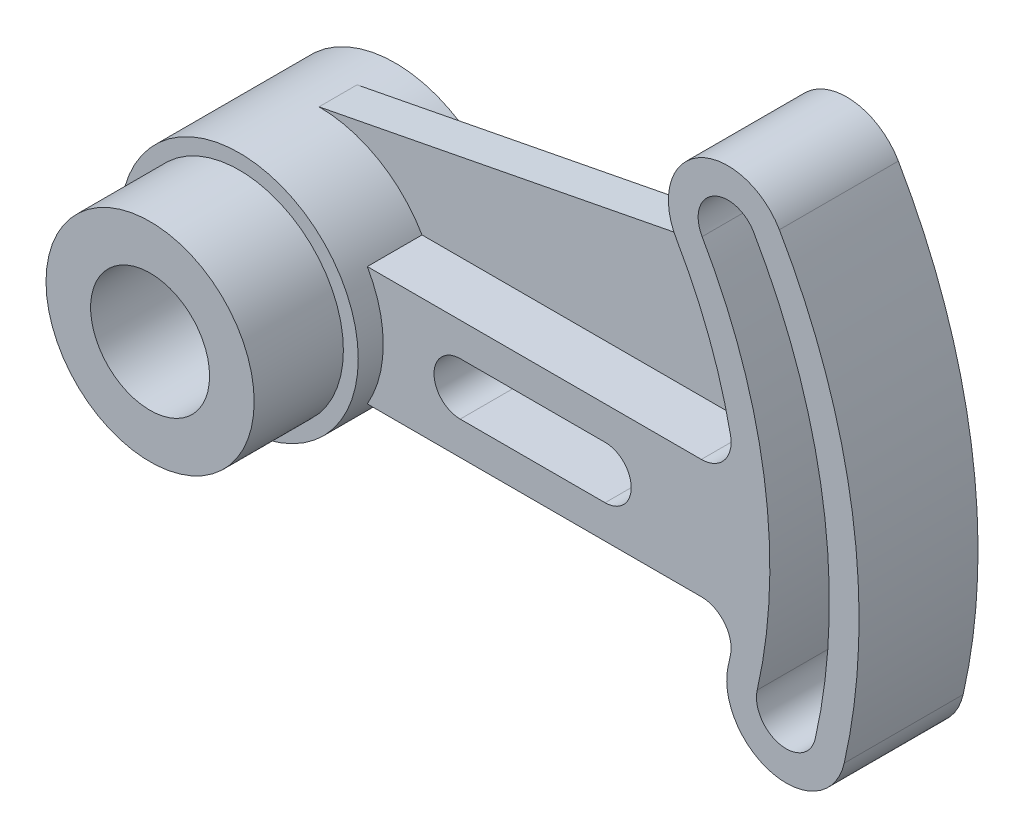
ISO-10303-21;
HEADER;
FILE_DESCRIPTION(('STEP AP214'),'2;1');
FILE_NAME('part.step','',(''),(''),'','','');
FILE_SCHEMA(('AUTOMOTIVE_DESIGN { 1 0 10303 214 1 1 1 1 }'));
ENDSEC;
DATA;
#1=APPLICATION_CONTEXT('core data for automotive mechanical design processes');
#2=APPLICATION_PROTOCOL_DEFINITION('international standard','automotive_design',2000,#1);
#3=PRODUCT_CONTEXT('',#1,'mechanical');
#4=PRODUCT('Part','Part','',(#3));
#5=PRODUCT_RELATED_PRODUCT_CATEGORY('part','',(#4));
#6=PRODUCT_DEFINITION_FORMATION('','',#4);
#7=PRODUCT_DEFINITION_CONTEXT('part definition',#1,'design');
#8=PRODUCT_DEFINITION('design','',#6,#7);
#9=PRODUCT_DEFINITION_SHAPE('','',#8);
#10=(LENGTH_UNIT() NAMED_UNIT(*) SI_UNIT(.MILLI.,.METRE.));
#11=(NAMED_UNIT(*) PLANE_ANGLE_UNIT() SI_UNIT($,.RADIAN.));
#12=(NAMED_UNIT(*) SI_UNIT($,.STERADIAN.) SOLID_ANGLE_UNIT());
#13=UNCERTAINTY_MEASURE_WITH_UNIT(LENGTH_MEASURE(1.E-05),#10,'distance_accuracy_value','');
#14=(GEOMETRIC_REPRESENTATION_CONTEXT(3) GLOBAL_UNCERTAINTY_ASSIGNED_CONTEXT((#13)) GLOBAL_UNIT_ASSIGNED_CONTEXT((#10,
#11,#12)) REPRESENTATION_CONTEXT('',''));
#15=CARTESIAN_POINT('',(0.,0.,0.));
#16=DIRECTION('',(0.,0.,1.));
#17=DIRECTION('',(1.,0.,0.));
#18=AXIS2_PLACEMENT_3D('',#15,#16,#17);
#19=CARTESIAN_POINT('',(0.,0.,27.94));
#20=DIRECTION('',(0.,0.,-1.));
#21=DIRECTION('',(-1.,0.,0.));
#22=AXIS2_PLACEMENT_3D('',#19,#20,#21);
#23=CYLINDRICAL_SURFACE('',#22,101.6);
#24=CARTESIAN_POINT('',(0.,0.,8.128));
#25=DIRECTION('',(0.,0.,1.));
#26=DIRECTION('',(1.,0.,0.));
#27=AXIS2_PLACEMENT_3D('',#24,#25,#26);
#28=CIRCLE('',#27,101.6);
#29=CARTESIAN_POINT('',(99.5472631467083,20.32,8.128));
#30=VERTEX_POINT('',#29);
#31=CARTESIAN_POINT('',(87.9881810244989,50.8000000000001,8.128));
#32=VERTEX_POINT('',#31);
#33=EDGE_CURVE('E55',#30,#32,#28,.T.);
#34=ORIENTED_EDGE('',*,*,#33,.T.);
#35=DIRECTION('',(0.,0.,-1.));
#36=VECTOR('',#35,1.);
#37=CARTESIAN_POINT('',(87.9881810244989,50.8000000000001,27.94));
#38=LINE('',#37,#36);
#39=CARTESIAN_POINT('',(87.9881810244989,50.8000000000001,2.54));
#40=VERTEX_POINT('',#39);
#41=EDGE_CURVE('E389',#32,#40,#38,.T.);
#42=ORIENTED_EDGE('',*,*,#41,.T.);
#43=CARTESIAN_POINT('',(0.,0.,2.54));
#44=DIRECTION('',(0.,0.,-1.));
#45=DIRECTION('',(-1.,0.,0.));
#46=AXIS2_PLACEMENT_3D('',#43,#44,#45);
#47=CIRCLE('',#46,101.6);
#48=CARTESIAN_POINT('',(99.5472631467083,20.32,2.54));
#49=VERTEX_POINT('',#48);
#50=EDGE_CURVE('E379',#40,#49,#47,.T.);
#51=ORIENTED_EDGE('',*,*,#50,.T.);
#52=DIRECTION('',(0.,0.,-1.));
#53=VECTOR('',#52,1.);
#54=CARTESIAN_POINT('',(99.5472631467083,20.32,27.94));
#55=LINE('',#54,#53);
#56=EDGE_CURVE('E456',#49,#30,#55,.F.);
#57=ORIENTED_EDGE('',*,*,#56,.T.);
#58=EDGE_LOOP('',(#34,#42,#51,#57));
#59=FACE_BOUND('',#58,.T.);
#60=ADVANCED_FACE('F39',(#59),#23,.F.);
#61=CARTESIAN_POINT('',(21.9970452561247,12.7,27.94));
#62=DIRECTION('',(0.,1.,0.));
#63=DIRECTION('',(0.,0.,1.));
#64=AXIS2_PLACEMENT_3D('',#61,#62,#63);
#65=PLANE('',#64);
#66=DIRECTION('',(0.,0.,-1.));
#67=VECTOR('',#66,1.);
#68=CARTESIAN_POINT('',(21.9970452561247,12.7,27.94));
#69=LINE('',#68,#67);
#70=CARTESIAN_POINT('',(21.9970452561247,12.7,8.128));
#71=VERTEX_POINT('',#70);
#72=CARTESIAN_POINT('',(21.9970452561247,12.7,2.54));
#73=VERTEX_POINT('',#72);
#74=EDGE_CURVE('E223',#71,#73,#69,.T.);
#75=ORIENTED_EDGE('',*,*,#74,.F.);
#76=DIRECTION('',(1.,0.,0.));
#77=VECTOR('',#76,1.);
#78=CARTESIAN_POINT('',(21.9970452561247,12.7,8.128));
#79=LINE('',#78,#77);
#80=CARTESIAN_POINT('',(93.3255592000391,12.7,8.128));
#81=VERTEX_POINT('',#80);
#82=EDGE_CURVE('E221',#71,#81,#79,.T.);
#83=ORIENTED_EDGE('',*,*,#82,.T.);
#84=DIRECTION('',(0.,0.,-1.));
#85=VECTOR('',#84,1.);
#86=CARTESIAN_POINT('',(93.3255592000391,12.7,27.94));
#87=LINE('',#86,#85);
#88=CARTESIAN_POINT('',(93.3255592000391,12.7,2.54));
#89=VERTEX_POINT('',#88);
#90=EDGE_CURVE('E205',#81,#89,#87,.T.);
#91=ORIENTED_EDGE('',*,*,#90,.T.);
#92=DIRECTION('',(1.,0.,0.));
#93=VECTOR('',#92,1.);
#94=CARTESIAN_POINT('',(21.9970452561247,12.7,2.54));
#95=LINE('',#94,#93);
#96=EDGE_CURVE('E340',#73,#89,#95,.T.);
#97=ORIENTED_EDGE('',*,*,#96,.F.);
#98=EDGE_LOOP('',(#75,#83,#91,#97));
#99=FACE_BOUND('',#98,.T.);
#100=ADVANCED_FACE('F222',(#99),#65,.T.);
#101=CARTESIAN_POINT('',(93.3255592000391,19.05,27.94));
#102=DIRECTION('',(0.,0.,-1.));
#103=DIRECTION('',(-1.,0.,0.));
#104=AXIS2_PLACEMENT_3D('',#101,#102,#103);
#105=CYLINDRICAL_SURFACE('',#104,6.35);
#106=CARTESIAN_POINT('',(93.3255592000391,19.05,8.128));
#107=DIRECTION('',(0.,0.,1.));
#108=DIRECTION('',(1.,0.,0.));
#109=AXIS2_PLACEMENT_3D('',#106,#107,#108);
#110=CIRCLE('',#109,6.35);
#111=EDGE_CURVE('E210',#81,#30,#110,.T.);
#112=ORIENTED_EDGE('',*,*,#111,.T.);
#113=ORIENTED_EDGE('',*,*,#56,.F.);
#114=CARTESIAN_POINT('',(93.3255592000391,19.05,2.54));
#115=DIRECTION('',(0.,0.,1.));
#116=DIRECTION('',(1.,0.,0.));
#117=AXIS2_PLACEMENT_3D('',#114,#115,#116);
#118=CIRCLE('',#117,6.35);
#119=EDGE_CURVE('E211',#89,#49,#118,.T.);
#120=ORIENTED_EDGE('',*,*,#119,.F.);
#121=ORIENTED_EDGE('',*,*,#90,.F.);
#122=EDGE_LOOP('',(#112,#113,#120,#121));
#123=FACE_BOUND('',#122,.T.);
#124=ADVANCED_FACE('F207',(#123),#105,.F.);
#125=CARTESIAN_POINT('',(0.,0.,27.94));
#126=DIRECTION('',(0.,0.,1.));
#127=DIRECTION('',(1.,0.,0.));
#128=AXIS2_PLACEMENT_3D('',#125,#126,#127);
#129=PLANE('',#128);
#130=CARTESIAN_POINT('',(0.,0.,27.94));
#131=DIRECTION('',(0.,0.,1.));
#132=DIRECTION('',(1.,0.,0.));
#133=AXIS2_PLACEMENT_3D('',#130,#131,#132);
#134=CIRCLE('',#133,25.4);
#135=CARTESIAN_POINT('',(21.9970452561247,-12.7,27.94));
#136=VERTEX_POINT('',#135);
#137=CARTESIAN_POINT('',(21.9970452561247,12.7,27.94));
#138=VERTEX_POINT('',#137);
#139=EDGE_CURVE('E413',#136,#138,#134,.T.);
#140=ORIENTED_EDGE('',*,*,#139,.F.);
#141=DIRECTION('',(1.,0.,0.));
#142=VECTOR('',#141,1.);
#143=CARTESIAN_POINT('',(21.9970452561247,-12.7,27.94));
#144=LINE('',#143,#142);
#145=CARTESIAN_POINT('',(93.3255592000391,-12.7,27.94));
#146=VERTEX_POINT('',#145);
#147=EDGE_CURVE('E335',#136,#146,#144,.T.);
#148=ORIENTED_EDGE('',*,*,#147,.T.);
#149=CARTESIAN_POINT('',(93.3255592000391,-19.05,27.94));
#150=DIRECTION('',(0.,0.,1.));
#151=DIRECTION('',(1.,0.,0.));
#152=AXIS2_PLACEMENT_3D('',#149,#150,#151);
#153=CIRCLE('',#152,6.35);
#154=CARTESIAN_POINT('',(99.5472631467083,-20.32,27.94));
#155=VERTEX_POINT('',#154);
#156=EDGE_CURVE('E462',#146,#155,#153,.F.);
#157=ORIENTED_EDGE('',*,*,#156,.T.);
#158=CARTESIAN_POINT('',(0.,0.,27.94));
#159=DIRECTION('',(0.,0.,-1.));
#160=DIRECTION('',(-1.,0.,0.));
#161=AXIS2_PLACEMENT_3D('',#158,#159,#160);
#162=CIRCLE('',#161,101.6);
#163=CARTESIAN_POINT('',(99.0595979732266,-22.5777777777778,27.94));
#164=VERTEX_POINT('',#163);
#165=EDGE_CURVE('E339',#155,#164,#162,.T.);
#166=ORIENTED_EDGE('',*,*,#165,.T.);
#167=CARTESIAN_POINT('',(111.44204771988,-25.4,27.94));
#168=DIRECTION('',(0.,0.,1.));
#169=DIRECTION('',(1.,0.,0.));
#170=AXIS2_PLACEMENT_3D('',#167,#168,#169);
#171=CIRCLE('',#170,12.7);
#172=CARTESIAN_POINT('',(123.824497466533,-28.2222222222222,27.94));
#173=VERTEX_POINT('',#172);
#174=EDGE_CURVE('E343',#164,#173,#171,.T.);
#175=ORIENTED_EDGE('',*,*,#174,.T.);
#176=CARTESIAN_POINT('',(0.,0.,27.94));
#177=DIRECTION('',(0.,0.,-1.));
#178=DIRECTION('',(-1.,0.,0.));
#179=AXIS2_PLACEMENT_3D('',#176,#177,#178);
#180=CIRCLE('',#179,127.);
#181=CARTESIAN_POINT('',(109.985226280624,63.5000000000002,27.94));
#182=VERTEX_POINT('',#181);
#183=EDGE_CURVE('E346',#182,#173,#180,.T.);
#184=ORIENTED_EDGE('',*,*,#183,.F.);
#185=CARTESIAN_POINT('',(98.9867036525612,57.1500000000002,27.94));
#186=DIRECTION('',(0.,0.,1.));
#187=DIRECTION('',(1.,0.,0.));
#188=AXIS2_PLACEMENT_3D('',#185,#186,#187);
#189=CIRCLE('',#188,12.7);
#190=CARTESIAN_POINT('',(87.9881810244989,50.8000000000001,27.94));
#191=VERTEX_POINT('',#190);
#192=EDGE_CURVE('E350',#182,#191,#189,.T.);
#193=ORIENTED_EDGE('',*,*,#192,.T.);
#194=CARTESIAN_POINT('',(0.,0.,27.94));
#195=DIRECTION('',(0.,0.,-1.));
#196=DIRECTION('',(-1.,0.,0.));
#197=AXIS2_PLACEMENT_3D('',#194,#195,#196);
#198=CIRCLE('',#197,101.6);
#199=CARTESIAN_POINT('',(99.5472631467083,20.32,27.94));
#200=VERTEX_POINT('',#199);
#201=EDGE_CURVE('E353',#191,#200,#198,.T.);
#202=ORIENTED_EDGE('',*,*,#201,.T.);
#203=CARTESIAN_POINT('',(93.3255592000391,19.05,27.94));
#204=DIRECTION('',(0.,0.,1.));
#205=DIRECTION('',(1.,0.,0.));
#206=AXIS2_PLACEMENT_3D('',#203,#204,#205);
#207=CIRCLE('',#206,6.35);
#208=CARTESIAN_POINT('',(93.3255592000391,12.7,27.94));
#209=VERTEX_POINT('',#208);
#210=EDGE_CURVE('E467',#200,#209,#207,.F.);
#211=ORIENTED_EDGE('',*,*,#210,.T.);
#212=DIRECTION('',(1.,0.,0.));
#213=VECTOR('',#212,1.);
#214=CARTESIAN_POINT('',(21.9970452561247,12.7,27.94));
#215=LINE('',#214,#213);
#216=EDGE_CURVE('E357',#138,#209,#215,.T.);
#217=ORIENTED_EDGE('',*,*,#216,.F.);
#218=EDGE_LOOP('',(#140,#148,#157,#166,#175,#184,#193,#202,#211,#217));
#219=FACE_BOUND('',#218,.T.);
#220=CARTESIAN_POINT('',(0.,0.,27.94));
#221=DIRECTION('',(0.,0.,1.));
#222=DIRECTION('',(1.,0.,0.));
#223=AXIS2_PLACEMENT_3D('',#220,#221,#222);
#224=CIRCLE('',#223,120.65);
#225=CARTESIAN_POINT('',(104.485964966592,60.3250000000001,27.94));
#226=VERTEX_POINT('',#225);
#227=CARTESIAN_POINT('',(117.633272593207,-26.8111111111111,27.94));
#228=VERTEX_POINT('',#227);
#229=EDGE_CURVE('E310',#226,#228,#224,.F.);
#230=ORIENTED_EDGE('',*,*,#229,.T.);
#231=CARTESIAN_POINT('',(111.44204771988,-25.4,27.94));
#232=DIRECTION('',(0.,0.,1.));
#233=DIRECTION('',(1.,0.,0.));
#234=AXIS2_PLACEMENT_3D('',#231,#232,#233);
#235=CIRCLE('',#234,6.34999999999999);
#236=CARTESIAN_POINT('',(105.250822846553,-23.9888888888889,27.94));
#237=VERTEX_POINT('',#236);
#238=EDGE_CURVE('E314',#228,#237,#235,.F.);
#239=ORIENTED_EDGE('',*,*,#238,.T.);
#240=CARTESIAN_POINT('',(0.,0.,27.94));
#241=DIRECTION('',(0.,0.,1.));
#242=DIRECTION('',(1.,0.,0.));
#243=AXIS2_PLACEMENT_3D('',#240,#241,#242);
#244=CIRCLE('',#243,107.95);
#245=CARTESIAN_POINT('',(93.4874423385301,53.9750000000002,27.94));
#246=VERTEX_POINT('',#245);
#247=EDGE_CURVE('E275',#237,#246,#244,.T.);
#248=ORIENTED_EDGE('',*,*,#247,.T.);
#249=CARTESIAN_POINT('',(98.9867036525612,57.1500000000002,27.94));
#250=DIRECTION('',(0.,0.,1.));
#251=DIRECTION('',(1.,0.,0.));
#252=AXIS2_PLACEMENT_3D('',#249,#250,#251);
#253=CIRCLE('',#252,6.34999999999998);
#254=EDGE_CURVE('E306',#246,#226,#253,.F.);
#255=ORIENTED_EDGE('',*,*,#254,.T.);
#256=EDGE_LOOP('',(#230,#239,#248,#255));
#257=FACE_BOUND('',#256,.T.);
#258=DIRECTION('',(-1.,0.,0.));
#259=VECTOR('',#258,1.);
#260=CARTESIAN_POINT('',(0.,-5.58800000000001,27.94));
#261=LINE('',#260,#259);
#262=CARTESIAN_POINT('',(72.7664661050943,-5.58799999999999,27.94));
#263=VERTEX_POINT('',#262);
#264=CARTESIAN_POINT('',(41.8340954673085,-5.588,27.94));
#265=VERTEX_POINT('',#264);
#266=EDGE_CURVE('E326',#263,#265,#261,.T.);
#267=ORIENTED_EDGE('',*,*,#266,.T.);
#268=CARTESIAN_POINT('',(41.8340954673085,0.,27.94));
#269=DIRECTION('',(0.,0.,1.));
#270=DIRECTION('',(1.,0.,0.));
#271=AXIS2_PLACEMENT_3D('',#268,#269,#270);
#272=CIRCLE('',#271,5.588);
#273=CARTESIAN_POINT('',(41.8340954673085,5.588,27.94));
#274=VERTEX_POINT('',#273);
#275=EDGE_CURVE('E330',#265,#274,#272,.F.);
#276=ORIENTED_EDGE('',*,*,#275,.T.);
#277=DIRECTION('',(1.,0.,0.));
#278=VECTOR('',#277,1.);
#279=CARTESIAN_POINT('',(0.,5.58800000000001,27.94));
#280=LINE('',#279,#278);
#281=CARTESIAN_POINT('',(72.7664661050943,5.58799999999999,27.94));
#282=VERTEX_POINT('',#281);
#283=EDGE_CURVE('E318',#274,#282,#280,.T.);
#284=ORIENTED_EDGE('',*,*,#283,.T.);
#285=CARTESIAN_POINT('',(72.7664661050943,0.,27.94));
#286=DIRECTION('',(0.,0.,1.));
#287=DIRECTION('',(1.,0.,0.));
#288=AXIS2_PLACEMENT_3D('',#285,#286,#287);
#289=CIRCLE('',#288,5.58799999999999);
#290=EDGE_CURVE('E322',#282,#263,#289,.F.);
#291=ORIENTED_EDGE('',*,*,#290,.T.);
#292=EDGE_LOOP('',(#267,#276,#284,#291));
#293=FACE_BOUND('',#292,.T.);
#294=ADVANCED_FACE('F535',(#219,#257,#293),#129,.T.);
#295=CARTESIAN_POINT('',(0.,0.,2.54));
#296=DIRECTION('',(0.,0.,1.));
#297=DIRECTION('',(1.,0.,0.));
#298=AXIS2_PLACEMENT_3D('',#295,#296,#297);
#299=PLANE('',#298);
#300=CARTESIAN_POINT('',(111.44204771988,-25.4,2.54));
#301=DIRECTION('',(0.,0.,1.));
#302=DIRECTION('',(1.,0.,0.));
#303=AXIS2_PLACEMENT_3D('',#300,#301,#302);
#304=CIRCLE('',#303,6.34999999999999);
#305=CARTESIAN_POINT('',(105.250822846553,-23.9888888888889,2.54));
#306=VERTEX_POINT('',#305);
#307=CARTESIAN_POINT('',(117.633272593207,-26.8111111111111,2.54));
#308=VERTEX_POINT('',#307);
#309=EDGE_CURVE('E243',#306,#308,#304,.T.);
#310=ORIENTED_EDGE('',*,*,#309,.T.);
#311=CARTESIAN_POINT('',(0.,0.,2.54));
#312=DIRECTION('',(0.,0.,1.));
#313=DIRECTION('',(1.,0.,0.));
#314=AXIS2_PLACEMENT_3D('',#311,#312,#313);
#315=CIRCLE('',#314,120.65);
#316=CARTESIAN_POINT('',(104.485964966592,60.3250000000001,2.54));
#317=VERTEX_POINT('',#316);
#318=EDGE_CURVE('E279',#308,#317,#315,.T.);
#319=ORIENTED_EDGE('',*,*,#318,.T.);
#320=CARTESIAN_POINT('',(98.9867036525612,57.1500000000002,2.54));
#321=DIRECTION('',(0.,0.,1.));
#322=DIRECTION('',(1.,0.,0.));
#323=AXIS2_PLACEMENT_3D('',#320,#321,#322);
#324=CIRCLE('',#323,6.34999999999998);
#325=CARTESIAN_POINT('',(93.4874423385301,53.9750000000002,2.54));
#326=VERTEX_POINT('',#325);
#327=EDGE_CURVE('E283',#317,#326,#324,.T.);
#328=ORIENTED_EDGE('',*,*,#327,.T.);
#329=CARTESIAN_POINT('',(0.,0.,2.54));
#330=DIRECTION('',(0.,0.,-1.));
#331=DIRECTION('',(1.,0.,0.));
#332=AXIS2_PLACEMENT_3D('',#329,#330,#331);
#333=CIRCLE('',#332,107.95);
#334=EDGE_CURVE('E287',#326,#306,#333,.T.);
#335=ORIENTED_EDGE('',*,*,#334,.T.);
#336=EDGE_LOOP('',(#310,#319,#328,#335));
#337=FACE_BOUND('',#336,.T.);
#338=DIRECTION('',(1.,0.,0.));
#339=VECTOR('',#338,1.);
#340=CARTESIAN_POINT('',(21.9970452561247,-12.7,2.54));
#341=LINE('',#340,#339);
#342=CARTESIAN_POINT('',(21.9970452561247,-12.7,2.54));
#343=VERTEX_POINT('',#342);
#344=CARTESIAN_POINT('',(93.3255592000391,-12.7,2.54));
#345=VERTEX_POINT('',#344);
#346=EDGE_CURVE('E334',#343,#345,#341,.T.);
#347=ORIENTED_EDGE('',*,*,#346,.F.);
#348=CARTESIAN_POINT('',(0.,0.,2.54));
#349=DIRECTION('',(0.,0.,1.));
#350=DIRECTION('',(1.,0.,0.));
#351=AXIS2_PLACEMENT_3D('',#348,#349,#350);
#352=CIRCLE('',#351,25.4);
#353=EDGE_CURVE('E409',#343,#73,#352,.T.);
#354=ORIENTED_EDGE('',*,*,#353,.T.);
#355=ORIENTED_EDGE('',*,*,#96,.T.);
#356=ORIENTED_EDGE('',*,*,#119,.T.);
#357=ORIENTED_EDGE('',*,*,#50,.F.);
#358=CARTESIAN_POINT('',(98.9867036525612,57.1500000000002,2.54));
#359=DIRECTION('',(0.,0.,1.));
#360=DIRECTION('',(1.,0.,0.));
#361=AXIS2_PLACEMENT_3D('',#358,#359,#360);
#362=CIRCLE('',#361,12.7);
#363=CARTESIAN_POINT('',(109.985226280624,63.5000000000002,2.54));
#364=VERTEX_POINT('',#363);
#365=EDGE_CURVE('E375',#364,#40,#362,.T.);
#366=ORIENTED_EDGE('',*,*,#365,.F.);
#367=CARTESIAN_POINT('',(0.,0.,2.54));
#368=DIRECTION('',(0.,0.,-1.));
#369=DIRECTION('',(-1.,0.,0.));
#370=AXIS2_PLACEMENT_3D('',#367,#368,#369);
#371=CIRCLE('',#370,127.);
#372=CARTESIAN_POINT('',(123.824497466533,-28.2222222222222,2.54));
#373=VERTEX_POINT('',#372);
#374=EDGE_CURVE('E371',#364,#373,#371,.T.);
#375=ORIENTED_EDGE('',*,*,#374,.T.);
#376=CARTESIAN_POINT('',(111.44204771988,-25.4,2.54));
#377=DIRECTION('',(0.,0.,1.));
#378=DIRECTION('',(1.,0.,0.));
#379=AXIS2_PLACEMENT_3D('',#376,#377,#378);
#380=CIRCLE('',#379,12.7);
#381=CARTESIAN_POINT('',(99.0595979732266,-22.5777777777778,2.54));
#382=VERTEX_POINT('',#381);
#383=EDGE_CURVE('E367',#382,#373,#380,.T.);
#384=ORIENTED_EDGE('',*,*,#383,.F.);
#385=CARTESIAN_POINT('',(0.,0.,2.54));
#386=DIRECTION('',(0.,0.,-1.));
#387=DIRECTION('',(-1.,0.,0.));
#388=AXIS2_PLACEMENT_3D('',#385,#386,#387);
#389=CIRCLE('',#388,101.6);
#390=CARTESIAN_POINT('',(99.5472631467083,-20.32,2.54));
#391=VERTEX_POINT('',#390);
#392=EDGE_CURVE('E364',#391,#382,#389,.T.);
#393=ORIENTED_EDGE('',*,*,#392,.F.);
#394=CARTESIAN_POINT('',(93.3255592000391,-19.05,2.54));
#395=DIRECTION('',(0.,0.,1.));
#396=DIRECTION('',(1.,0.,0.));
#397=AXIS2_PLACEMENT_3D('',#394,#395,#396);
#398=CIRCLE('',#397,6.35);
#399=EDGE_CURVE('E459',#391,#345,#398,.T.);
#400=ORIENTED_EDGE('',*,*,#399,.T.);
#401=EDGE_LOOP('',(#347,#354,#355,#356,#357,#366,#375,#384,#393,#400));
#402=FACE_BOUND('',#401,.T.);
#403=CARTESIAN_POINT('',(41.8340954673085,0.,2.54));
#404=DIRECTION('',(0.,0.,1.));
#405=DIRECTION('',(1.,0.,0.));
#406=AXIS2_PLACEMENT_3D('',#403,#404,#405);
#407=CIRCLE('',#406,5.588);
#408=CARTESIAN_POINT('',(41.8340954673085,5.588,2.54));
#409=VERTEX_POINT('',#408);
#410=CARTESIAN_POINT('',(41.8340954673085,-5.588,2.54));
#411=VERTEX_POINT('',#410);
#412=EDGE_CURVE('E245',#409,#411,#407,.T.);
#413=ORIENTED_EDGE('',*,*,#412,.T.);
#414=DIRECTION('',(1.,0.,0.));
#415=VECTOR('',#414,1.);
#416=CARTESIAN_POINT('',(41.8340954673085,-5.588,2.54));
#417=LINE('',#416,#415);
#418=CARTESIAN_POINT('',(72.7664661050943,-5.58799999999999,2.54));
#419=VERTEX_POINT('',#418);
#420=EDGE_CURVE('E249',#411,#419,#417,.T.);
#421=ORIENTED_EDGE('',*,*,#420,.T.);
#422=CARTESIAN_POINT('',(72.7664661050943,0.,2.54));
#423=DIRECTION('',(0.,0.,1.));
#424=DIRECTION('',(1.,0.,0.));
#425=AXIS2_PLACEMENT_3D('',#422,#423,#424);
#426=CIRCLE('',#425,5.58799999999999);
#427=CARTESIAN_POINT('',(72.7664661050943,5.58799999999999,2.54));
#428=VERTEX_POINT('',#427);
#429=EDGE_CURVE('E254',#419,#428,#426,.T.);
#430=ORIENTED_EDGE('',*,*,#429,.T.);
#431=DIRECTION('',(-1.,0.,0.));
#432=VECTOR('',#431,1.);
#433=CARTESIAN_POINT('',(41.8340954673085,5.588,2.54));
#434=LINE('',#433,#432);
#435=EDGE_CURVE('E258',#428,#409,#434,.T.);
#436=ORIENTED_EDGE('',*,*,#435,.T.);
#437=EDGE_LOOP('',(#413,#421,#430,#436));
#438=FACE_BOUND('',#437,.T.);
#439=ADVANCED_FACE('F526',(#337,#402,#438),#299,.F.);
#440=CARTESIAN_POINT('',(0.,0.,52.324));
#441=DIRECTION('',(0.,0.,-1.));
#442=DIRECTION('',(-1.,0.,0.));
#443=AXIS2_PLACEMENT_3D('',#440,#441,#442);
#444=CYLINDRICAL_SURFACE('',#443,12.7);
#445=CARTESIAN_POINT('',(0.,0.,0.));
#446=DIRECTION('',(0.,0.,1.));
#447=DIRECTION('',(1.,0.,0.));
#448=AXIS2_PLACEMENT_3D('',#445,#446,#447);
#449=CIRCLE('',#448,12.7);
#450=CARTESIAN_POINT('',(12.7,0.,0.));
#451=VERTEX_POINT('',#450);
#452=EDGE_CURVE('E416',#451,#451,#449,.T.);
#453=ORIENTED_EDGE('',*,*,#452,.F.);
#454=EDGE_LOOP('',(#453));
#455=FACE_BOUND('',#454,.T.);
#456=CARTESIAN_POINT('',(0.,0.,2.54));
#457=DIRECTION('',(0.,0.,1.));
#458=DIRECTION('',(1.,0.,0.));
#459=AXIS2_PLACEMENT_3D('',#456,#457,#458);
#460=CIRCLE('',#459,12.7);
#461=CARTESIAN_POINT('',(12.7,0.,2.54));
#462=VERTEX_POINT('',#461);
#463=EDGE_CURVE('E408',#462,#462,#460,.T.);
#464=ORIENTED_EDGE('',*,*,#463,.T.);
#465=EDGE_LOOP('',(#464));
#466=FACE_BOUND('',#465,.T.);
#467=ADVANCED_FACE('F607',(#455,#466),#444,.F.);
#468=CARTESIAN_POINT('',(0.,0.,33.274));
#469=DIRECTION('',(0.,0.,-1.));
#470=DIRECTION('',(-1.,0.,0.));
#471=AXIS2_PLACEMENT_3D('',#468,#469,#470);
#472=CYLINDRICAL_SURFACE('',#471,25.4);
#473=CARTESIAN_POINT('',(21.9970452561247,12.7,16.256));
#474=VERTEX_POINT('',#473);
#475=EDGE_CURVE('E385',#138,#474,#69,.T.);
#476=ORIENTED_EDGE('',*,*,#475,.T.);
#477=CARTESIAN_POINT('',(0.,0.,16.256));
#478=DIRECTION('',(0.,0.,-1.));
#479=DIRECTION('',(1.,0.,0.));
#480=AXIS2_PLACEMENT_3D('',#477,#478,#479);
#481=CIRCLE('',#480,25.4);
#482=CARTESIAN_POINT('',(0.,25.4,16.256));
#483=VERTEX_POINT('',#482);
#484=EDGE_CURVE('E238',#483,#474,#481,.T.);
#485=ORIENTED_EDGE('',*,*,#484,.F.);
#486=DIRECTION('',(0.,0.,-1.));
#487=VECTOR('',#486,1.);
#488=CARTESIAN_POINT('',(0.,25.4,16.256));
#489=LINE('',#488,#487);
#490=CARTESIAN_POINT('',(0.,25.4,8.128));
#491=VERTEX_POINT('',#490);
#492=EDGE_CURVE('E239',#483,#491,#489,.T.);
#493=ORIENTED_EDGE('',*,*,#492,.T.);
#494=CARTESIAN_POINT('',(0.,0.,8.128));
#495=DIRECTION('',(0.,0.,-1.));
#496=DIRECTION('',(1.,0.,0.));
#497=AXIS2_PLACEMENT_3D('',#494,#495,#496);
#498=CIRCLE('',#497,25.4);
#499=EDGE_CURVE('E226',#491,#71,#498,.T.);
#500=ORIENTED_EDGE('',*,*,#499,.T.);
#501=ORIENTED_EDGE('',*,*,#74,.T.);
#502=ORIENTED_EDGE('',*,*,#353,.F.);
#503=DIRECTION('',(0.,0.,-1.));
#504=VECTOR('',#503,1.);
#505=CARTESIAN_POINT('',(21.9970452561247,-12.7,27.94));
#506=LINE('',#505,#504);
#507=EDGE_CURVE('E404',#136,#343,#506,.T.);
#508=ORIENTED_EDGE('',*,*,#507,.F.);
#509=ORIENTED_EDGE('',*,*,#139,.T.);
#510=EDGE_LOOP('',(#476,#485,#493,#500,#501,#502,#508,#509));
#511=FACE_BOUND('',#510,.T.);
#512=CARTESIAN_POINT('',(0.,0.,33.274));
#513=DIRECTION('',(0.,0.,1.));
#514=DIRECTION('',(1.,0.,0.));
#515=AXIS2_PLACEMENT_3D('',#512,#513,#514);
#516=CIRCLE('',#515,25.4);
#517=CARTESIAN_POINT('',(25.4,0.,33.274));
#518=VERTEX_POINT('',#517);
#519=EDGE_CURVE('E434',#518,#518,#516,.T.);
#520=ORIENTED_EDGE('',*,*,#519,.F.);
#521=EDGE_LOOP('',(#520));
#522=FACE_BOUND('',#521,.T.);
#523=CARTESIAN_POINT('',(0.,0.,0.));
#524=DIRECTION('',(0.,0.,1.));
#525=DIRECTION('',(1.,0.,0.));
#526=AXIS2_PLACEMENT_3D('',#523,#524,#525);
#527=CIRCLE('',#526,25.4);
#528=CARTESIAN_POINT('',(25.4,0.,0.));
#529=VERTEX_POINT('',#528);
#530=EDGE_CURVE('E428',#529,#529,#527,.T.);
#531=ORIENTED_EDGE('',*,*,#530,.T.);
#532=EDGE_LOOP('',(#531));
#533=FACE_BOUND('',#532,.T.);
#534=ADVANCED_FACE('F508',(#511,#522,#533),#472,.T.);
#535=CARTESIAN_POINT('',(0.,0.,33.274));
#536=DIRECTION('',(0.,0.,1.));
#537=DIRECTION('',(1.,0.,0.));
#538=AXIS2_PLACEMENT_3D('',#535,#536,#537);
#539=PLANE('',#538);
#540=CARTESIAN_POINT('',(0.,0.,33.274));
#541=DIRECTION('',(0.,0.,1.));
#542=DIRECTION('',(1.,0.,0.));
#543=AXIS2_PLACEMENT_3D('',#540,#541,#542);
#544=CIRCLE('',#543,22.225);
#545=CARTESIAN_POINT('',(-22.225,0.,33.274));
#546=VERTEX_POINT('',#545);
#547=EDGE_CURVE('E429',#546,#546,#544,.T.);
#548=ORIENTED_EDGE('',*,*,#547,.F.);
#549=EDGE_LOOP('',(#548));
#550=FACE_BOUND('',#549,.T.);
#551=ORIENTED_EDGE('',*,*,#519,.T.);
#552=EDGE_LOOP('',(#551));
#553=FACE_BOUND('',#552,.T.);
#554=ADVANCED_FACE('F616',(#550,#553),#539,.T.);
#555=CARTESIAN_POINT('',(0.,0.,0.));
#556=DIRECTION('',(0.,0.,1.));
#557=DIRECTION('',(1.,0.,0.));
#558=AXIS2_PLACEMENT_3D('',#555,#556,#557);
#559=PLANE('',#558);
#560=ORIENTED_EDGE('',*,*,#452,.T.);
#561=EDGE_LOOP('',(#560));
#562=FACE_BOUND('',#561,.T.);
#563=ORIENTED_EDGE('',*,*,#530,.F.);
#564=EDGE_LOOP('',(#563));
#565=FACE_BOUND('',#564,.T.);
#566=ADVANCED_FACE('F614',(#562,#565),#559,.F.);
#567=CARTESIAN_POINT('',(0.,0.,52.324));
#568=DIRECTION('',(0.,0.,-1.));
#569=DIRECTION('',(-1.,0.,0.));
#570=AXIS2_PLACEMENT_3D('',#567,#568,#569);
#571=CYLINDRICAL_SURFACE('',#570,22.225);
#572=CARTESIAN_POINT('',(0.,0.,52.324));
#573=DIRECTION('',(0.,0.,1.));
#574=DIRECTION('',(1.,0.,0.));
#575=AXIS2_PLACEMENT_3D('',#572,#573,#574);
#576=CIRCLE('',#575,22.225);
#577=CARTESIAN_POINT('',(-22.225,0.,52.324));
#578=VERTEX_POINT('',#577);
#579=EDGE_CURVE('E421',#578,#578,#576,.T.);
#580=CARTESIAN_POINT('',(-22.225,0.,52.324));
#581=CARTESIAN_POINT('',(-22.225,0.,52.1255625));
#582=CARTESIAN_POINT('',(-22.225,0.,51.927125));
#583=CARTESIAN_POINT('',(-22.225,0.,51.53025));
#584=CARTESIAN_POINT('',(-22.225,0.,51.3318125));
#585=CARTESIAN_POINT('',(-22.225,0.,50.9349375));
#586=CARTESIAN_POINT('',(-22.225,0.,50.7365));
#587=CARTESIAN_POINT('',(-22.225,0.,50.339625));
#588=CARTESIAN_POINT('',(-22.225,0.,50.1411875));
#589=CARTESIAN_POINT('',(-22.225,0.,49.7443125));
#590=CARTESIAN_POINT('',(-22.225,0.,49.545875));
#591=CARTESIAN_POINT('',(-22.225,0.,49.149));
#592=CARTESIAN_POINT('',(-22.225,0.,48.9505625));
#593=CARTESIAN_POINT('',(-22.225,0.,48.5536875));
#594=CARTESIAN_POINT('',(-22.225,0.,48.35525));
#595=CARTESIAN_POINT('',(-22.225,0.,47.958375));
#596=CARTESIAN_POINT('',(-22.225,0.,47.7599375));
#597=CARTESIAN_POINT('',(-22.225,0.,47.3630625));
#598=CARTESIAN_POINT('',(-22.225,0.,47.164625));
#599=CARTESIAN_POINT('',(-22.225,0.,46.76775));
#600=CARTESIAN_POINT('',(-22.225,0.,46.5693125));
#601=CARTESIAN_POINT('',(-22.225,0.,46.1724375));
#602=CARTESIAN_POINT('',(-22.225,0.,45.974));
#603=CARTESIAN_POINT('',(-22.225,0.,45.577125));
#604=CARTESIAN_POINT('',(-22.225,0.,45.3786875));
#605=CARTESIAN_POINT('',(-22.225,0.,44.9818125));
#606=CARTESIAN_POINT('',(-22.225,0.,44.783375));
#607=CARTESIAN_POINT('',(-22.225,0.,44.3865));
#608=CARTESIAN_POINT('',(-22.225,0.,44.1880625));
#609=CARTESIAN_POINT('',(-22.225,0.,43.7911875));
#610=CARTESIAN_POINT('',(-22.225,0.,43.59275));
#611=CARTESIAN_POINT('',(-22.225,0.,43.195875));
#612=CARTESIAN_POINT('',(-22.225,0.,42.9974375));
#613=CARTESIAN_POINT('',(-22.225,0.,42.6005625));
#614=CARTESIAN_POINT('',(-22.225,0.,42.402125));
#615=CARTESIAN_POINT('',(-22.225,0.,42.00525));
#616=CARTESIAN_POINT('',(-22.225,0.,41.8068125));
#617=CARTESIAN_POINT('',(-22.225,0.,41.4099375));
#618=CARTESIAN_POINT('',(-22.225,0.,41.2115));
#619=CARTESIAN_POINT('',(-22.225,0.,40.814625));
#620=CARTESIAN_POINT('',(-22.225,0.,40.6161875));
#621=CARTESIAN_POINT('',(-22.225,0.,40.2193125));
#622=CARTESIAN_POINT('',(-22.225,0.,40.020875));
#623=CARTESIAN_POINT('',(-22.225,0.,39.624));
#624=CARTESIAN_POINT('',(-22.225,0.,39.4255625));
#625=CARTESIAN_POINT('',(-22.225,0.,39.0286875));
#626=CARTESIAN_POINT('',(-22.225,0.,38.83025));
#627=CARTESIAN_POINT('',(-22.225,0.,38.433375));
#628=CARTESIAN_POINT('',(-22.225,0.,38.2349375));
#629=CARTESIAN_POINT('',(-22.225,0.,37.8380625));
#630=CARTESIAN_POINT('',(-22.225,0.,37.639625));
#631=CARTESIAN_POINT('',(-22.225,0.,37.24275));
#632=CARTESIAN_POINT('',(-22.225,0.,37.0443125));
#633=CARTESIAN_POINT('',(-22.225,0.,36.6474375));
#634=CARTESIAN_POINT('',(-22.225,0.,36.449));
#635=CARTESIAN_POINT('',(-22.225,0.,36.052125));
#636=CARTESIAN_POINT('',(-22.225,0.,35.8536875));
#637=CARTESIAN_POINT('',(-22.225,0.,35.4568125));
#638=CARTESIAN_POINT('',(-22.225,0.,35.258375));
#639=CARTESIAN_POINT('',(-22.225,0.,34.8615));
#640=CARTESIAN_POINT('',(-22.225,0.,34.6630625));
#641=CARTESIAN_POINT('',(-22.225,0.,34.2661875));
#642=CARTESIAN_POINT('',(-22.225,0.,34.06775));
#643=CARTESIAN_POINT('',(-22.225,0.,33.670875));
#644=CARTESIAN_POINT('',(-22.225,0.,33.4724375));
#645=CARTESIAN_POINT('',(-22.225,0.,33.274));
#646=B_SPLINE_CURVE_WITH_KNOTS('',3,(#580,#581,#582,#583,#584,#585,#586,#587,#588,#589,#590,
#591,#592,#593,#594,#595,#596,#597,#598,#599,#600,#601,#602,#603,#604,#605,#606,#607,#608,#609,
#610,#611,#612,#613,#614,#615,#616,#617,#618,#619,#620,#621,#622,#623,#624,#625,#626,#627,#628,
#629,#630,#631,#632,#633,#634,#635,#636,#637,#638,#639,#640,#641,#642,#643,#644,#645),
.UNSPECIFIED.,.F.,.F.,(4,2,2,2,2,2,2,2,2,2,2,2,2,2,2,2,2,2,2,2,2,2,2,2,2,2,2,2,2,2,2,2,4),(0.,
0.5953125,1.190625,1.7859375,2.38125,2.9765625,3.571875,4.1671875,4.7625,5.3578125,5.953125,
6.5484375,7.14375,7.7390625,8.334375,8.92968750000001,9.52500000000001,10.1203125,10.715625,
11.3109375,11.90625,12.5015625,13.096875,13.6921875,14.2875,14.8828125,15.478125,16.0734375,
16.66875,17.2640625,17.859375,18.4546875,19.05),.UNSPECIFIED.);
#647=EDGE_CURVE('BSEAM610',#578,#546,#646,.T.);
#648=ORIENTED_EDGE('',*,*,#579,.F.);
#649=ORIENTED_EDGE('',*,*,#547,.T.);
#650=ORIENTED_EDGE('',*,*,#647,.T.);
#651=ORIENTED_EDGE('',*,*,#647,.F.);
#652=EDGE_LOOP('',(#648,#650,#649,#651));
#653=FACE_BOUND('',#652,.T.);
#654=ADVANCED_FACE('F610',(#653),#571,.T.);
#655=CARTESIAN_POINT('',(0.,0.,52.324));
#656=DIRECTION('',(0.,0.,1.));
#657=DIRECTION('',(1.,0.,0.));
#658=AXIS2_PLACEMENT_3D('',#655,#656,#657);
#659=PLANE('',#658);
#660=CARTESIAN_POINT('',(0.,0.,52.324));
#661=DIRECTION('',(0.,0.,1.));
#662=DIRECTION('',(1.,0.,0.));
#663=AXIS2_PLACEMENT_3D('',#660,#661,#662);
#664=CIRCLE('',#663,12.7);
#665=CARTESIAN_POINT('',(12.7,0.,52.324));
#666=VERTEX_POINT('',#665);
#667=EDGE_CURVE('E417',#666,#666,#664,.T.);
#668=ORIENTED_EDGE('',*,*,#667,.F.);
#669=EDGE_LOOP('',(#668));
#670=FACE_BOUND('',#669,.T.);
#671=ORIENTED_EDGE('',*,*,#579,.T.);
#672=EDGE_LOOP('',(#671));
#673=FACE_BOUND('',#672,.T.);
#674=ADVANCED_FACE('F605',(#670,#673),#659,.T.);
#675=CARTESIAN_POINT('',(0.,0.,27.94));
#676=DIRECTION('',(0.,0.,1.));
#677=DIRECTION('',(1.,0.,0.));
#678=AXIS2_PLACEMENT_3D('',#675,#676,#677);
#679=CIRCLE('',#678,12.7);
#680=CARTESIAN_POINT('',(12.7,0.,27.94));
#681=VERTEX_POINT('',#680);
#682=EDGE_CURVE('E433',#681,#681,#679,.T.);
#683=ORIENTED_EDGE('',*,*,#682,.F.);
#684=EDGE_LOOP('',(#683));
#685=FACE_BOUND('',#684,.T.);
#686=ORIENTED_EDGE('',*,*,#667,.T.);
#687=EDGE_LOOP('',(#686));
#688=FACE_BOUND('',#687,.T.);
#689=ADVANCED_FACE('F601',(#685,#688),#444,.F.);
#690=ORIENTED_EDGE('',*,*,#463,.F.);
#691=EDGE_LOOP('',(#690));
#692=FACE_BOUND('',#691,.T.);
#693=ADVANCED_FACE('F604',(#692),#299,.F.);
#694=ORIENTED_EDGE('',*,*,#682,.T.);
#695=EDGE_LOOP('',(#694));
#696=FACE_BOUND('',#695,.T.);
#697=ADVANCED_FACE('F600',(#696),#129,.T.);
#698=CARTESIAN_POINT('',(21.9970452561247,-12.7,27.94));
#699=DIRECTION('',(0.,1.,0.));
#700=DIRECTION('',(-1.,0.,0.));
#701=AXIS2_PLACEMENT_3D('',#698,#699,#700);
#702=PLANE('',#701);
#703=ORIENTED_EDGE('',*,*,#346,.T.);
#704=DIRECTION('',(0.,0.,1.));
#705=VECTOR('',#704,1.);
#706=CARTESIAN_POINT('',(93.3255592000391,-12.7,27.94));
#707=LINE('',#706,#705);
#708=EDGE_CURVE('E217',#345,#146,#707,.T.);
#709=ORIENTED_EDGE('',*,*,#708,.T.);
#710=ORIENTED_EDGE('',*,*,#147,.F.);
#711=ORIENTED_EDGE('',*,*,#507,.T.);
#712=EDGE_LOOP('',(#703,#709,#710,#711));
#713=FACE_BOUND('',#712,.T.);
#714=ADVANCED_FACE('F538',(#713),#702,.F.);
#715=CARTESIAN_POINT('',(0.,0.,27.94));
#716=DIRECTION('',(0.,0.,-1.));
#717=DIRECTION('',(-1.,0.,0.));
#718=AXIS2_PLACEMENT_3D('',#715,#716,#717);
#719=CYLINDRICAL_SURFACE('',#718,101.6);
#720=ORIENTED_EDGE('',*,*,#165,.F.);
#721=DIRECTION('',(0.,0.,-1.));
#722=VECTOR('',#721,1.);
#723=CARTESIAN_POINT('',(99.5472631467083,-20.32,27.94));
#724=LINE('',#723,#722);
#725=EDGE_CURVE('E447',#155,#391,#724,.T.);
#726=ORIENTED_EDGE('',*,*,#725,.T.);
#727=ORIENTED_EDGE('',*,*,#392,.T.);
#728=DIRECTION('',(0.,0.,-1.));
#729=VECTOR('',#728,1.);
#730=CARTESIAN_POINT('',(99.0595979732266,-22.5777777777778,27.94));
#731=LINE('',#730,#729);
#732=EDGE_CURVE('E400',#164,#382,#731,.T.);
#733=ORIENTED_EDGE('',*,*,#732,.F.);
#734=EDGE_LOOP('',(#720,#726,#727,#733));
#735=FACE_BOUND('',#734,.T.);
#736=ADVANCED_FACE('F546',(#735),#719,.F.);
#737=CARTESIAN_POINT('',(111.44204771988,-25.4,27.94));
#738=DIRECTION('',(0.,0.,-1.));
#739=DIRECTION('',(-1.,0.,0.));
#740=AXIS2_PLACEMENT_3D('',#737,#738,#739);
#741=CYLINDRICAL_SURFACE('',#740,12.7);
#742=ORIENTED_EDGE('',*,*,#383,.T.);
#743=DIRECTION('',(0.,0.,-1.));
#744=VECTOR('',#743,1.);
#745=CARTESIAN_POINT('',(123.824497466533,-28.2222222222222,27.94));
#746=LINE('',#745,#744);
#747=EDGE_CURVE('E397',#173,#373,#746,.T.);
#748=ORIENTED_EDGE('',*,*,#747,.F.);
#749=ORIENTED_EDGE('',*,*,#174,.F.);
#750=ORIENTED_EDGE('',*,*,#732,.T.);
#751=EDGE_LOOP('',(#742,#748,#749,#750));
#752=FACE_BOUND('',#751,.T.);
#753=ADVANCED_FACE('F552',(#752),#741,.T.);
#754=CARTESIAN_POINT('',(0.,0.,27.94));
#755=DIRECTION('',(0.,0.,-1.));
#756=DIRECTION('',(-1.,0.,0.));
#757=AXIS2_PLACEMENT_3D('',#754,#755,#756);
#758=CYLINDRICAL_SURFACE('',#757,127.);
#759=ORIENTED_EDGE('',*,*,#374,.F.);
#760=DIRECTION('',(0.,0.,-1.));
#761=VECTOR('',#760,1.);
#762=CARTESIAN_POINT('',(109.985226280624,63.5000000000002,27.94));
#763=LINE('',#762,#761);
#764=EDGE_CURVE('E394',#182,#364,#763,.T.);
#765=ORIENTED_EDGE('',*,*,#764,.F.);
#766=ORIENTED_EDGE('',*,*,#183,.T.);
#767=ORIENTED_EDGE('',*,*,#747,.T.);
#768=EDGE_LOOP('',(#759,#765,#766,#767));
#769=FACE_BOUND('',#768,.T.);
#770=ADVANCED_FACE('F556',(#769),#758,.T.);
#771=CARTESIAN_POINT('',(98.9867036525612,57.1500000000002,27.94));
#772=DIRECTION('',(0.,0.,-1.));
#773=DIRECTION('',(-1.,0.,0.));
#774=AXIS2_PLACEMENT_3D('',#771,#772,#773);
#775=CYLINDRICAL_SURFACE('',#774,12.7);
#776=ORIENTED_EDGE('',*,*,#41,.F.);
#777=CARTESIAN_POINT('',(98.9867036525612,57.1500000000002,8.128));
#778=DIRECTION('',(0.,0.,1.));
#779=DIRECTION('',(1.,0.,0.));
#780=AXIS2_PLACEMENT_3D('',#777,#778,#779);
#781=CIRCLE('',#780,12.7);
#782=CARTESIAN_POINT('',(87.8934565741374,50.9669692498711,8.128));
#783=VERTEX_POINT('',#782);
#784=EDGE_CURVE('E482',#32,#783,#781,.F.);
#785=ORIENTED_EDGE('',*,*,#784,.T.);
#786=DIRECTION('',(0.,0.,-1.));
#787=VECTOR('',#786,1.);
#788=CARTESIAN_POINT('',(87.8934565741374,50.9669692498711,27.94));
#789=LINE('',#788,#787);
#790=CARTESIAN_POINT('',(87.8934565741374,50.9669692498711,16.256));
#791=VERTEX_POINT('',#790);
#792=EDGE_CURVE('E478',#783,#791,#789,.F.);
#793=ORIENTED_EDGE('',*,*,#792,.T.);
#794=CARTESIAN_POINT('',(98.9867036525612,57.1500000000002,16.256));
#795=DIRECTION('',(0.,0.,1.));
#796=DIRECTION('',(1.,0.,0.));
#797=AXIS2_PLACEMENT_3D('',#794,#795,#796);
#798=CIRCLE('',#797,12.7);
#799=CARTESIAN_POINT('',(87.9881810244989,50.8000000000001,16.256));
#800=VERTEX_POINT('',#799);
#801=EDGE_CURVE('E474',#791,#800,#798,.T.);
#802=ORIENTED_EDGE('',*,*,#801,.T.);
#803=EDGE_CURVE('E390',#191,#800,#38,.T.);
#804=ORIENTED_EDGE('',*,*,#803,.F.);
#805=ORIENTED_EDGE('',*,*,#192,.F.);
#806=ORIENTED_EDGE('',*,*,#764,.T.);
#807=ORIENTED_EDGE('',*,*,#365,.T.);
#808=EDGE_LOOP('',(#776,#785,#793,#802,#804,#805,#806,#807));
#809=FACE_BOUND('',#808,.T.);
#810=ADVANCED_FACE('F520',(#809),#775,.T.);
#811=ORIENTED_EDGE('',*,*,#803,.T.);
#812=CARTESIAN_POINT('',(0.,0.,16.256));
#813=DIRECTION('',(0.,0.,1.));
#814=DIRECTION('',(1.,0.,0.));
#815=AXIS2_PLACEMENT_3D('',#812,#813,#814);
#816=CIRCLE('',#815,101.6);
#817=CARTESIAN_POINT('',(99.5472631467083,20.32,16.256));
#818=VERTEX_POINT('',#817);
#819=EDGE_CURVE('E490',#818,#800,#816,.T.);
#820=ORIENTED_EDGE('',*,*,#819,.F.);
#821=EDGE_CURVE('E455',#818,#200,#55,.F.);
#822=ORIENTED_EDGE('',*,*,#821,.T.);
#823=ORIENTED_EDGE('',*,*,#201,.F.);
#824=EDGE_LOOP('',(#811,#820,#822,#823));
#825=FACE_BOUND('',#824,.T.);
#826=ADVANCED_FACE('F559',(#825),#23,.F.);
#827=DIRECTION('',(1.,0.,0.));
#828=VECTOR('',#827,1.);
#829=CARTESIAN_POINT('',(21.9970452561247,12.7,16.256));
#830=LINE('',#829,#828);
#831=CARTESIAN_POINT('',(93.3255592000391,12.7,16.256));
#832=VERTEX_POINT('',#831);
#833=EDGE_CURVE('E497',#474,#832,#830,.T.);
#834=ORIENTED_EDGE('',*,*,#833,.F.);
#835=ORIENTED_EDGE('',*,*,#475,.F.);
#836=ORIENTED_EDGE('',*,*,#216,.T.);
#837=EDGE_CURVE('E216',#209,#832,#87,.T.);
#838=ORIENTED_EDGE('',*,*,#837,.T.);
#839=EDGE_LOOP('',(#834,#835,#836,#838));
#840=FACE_BOUND('',#839,.T.);
#841=ADVANCED_FACE('F566',(#840),#65,.T.);
#842=CARTESIAN_POINT('',(93.3255592000391,-19.05,27.94));
#843=DIRECTION('',(0.,0.,-1.));
#844=DIRECTION('',(-1.,0.,0.));
#845=AXIS2_PLACEMENT_3D('',#842,#843,#844);
#846=CYLINDRICAL_SURFACE('',#845,6.35);
#847=ORIENTED_EDGE('',*,*,#156,.F.);
#848=ORIENTED_EDGE('',*,*,#708,.F.);
#849=ORIENTED_EDGE('',*,*,#399,.F.);
#850=ORIENTED_EDGE('',*,*,#725,.F.);
#851=EDGE_LOOP('',(#847,#848,#849,#850));
#852=FACE_BOUND('',#851,.T.);
#853=ADVANCED_FACE('F541',(#852),#846,.F.);
#854=ORIENTED_EDGE('',*,*,#821,.F.);
#855=CARTESIAN_POINT('',(93.3255592000391,19.05,16.256));
#856=DIRECTION('',(0.,0.,1.));
#857=DIRECTION('',(1.,0.,0.));
#858=AXIS2_PLACEMENT_3D('',#855,#856,#857);
#859=CIRCLE('',#858,6.35);
#860=EDGE_CURVE('E493',#832,#818,#859,.T.);
#861=ORIENTED_EDGE('',*,*,#860,.F.);
#862=ORIENTED_EDGE('',*,*,#837,.F.);
#863=ORIENTED_EDGE('',*,*,#210,.F.);
#864=EDGE_LOOP('',(#854,#861,#862,#863));
#865=FACE_BOUND('',#864,.T.);
#866=ADVANCED_FACE('F564',(#865),#105,.F.);
#867=CARTESIAN_POINT('',(111.44204771988,-25.4,52.324));
#868=DIRECTION('',(0.,0.,-1.));
#869=DIRECTION('',(-1.,0.,0.));
#870=AXIS2_PLACEMENT_3D('',#867,#868,#869);
#871=CYLINDRICAL_SURFACE('',#870,6.34999999999999);
#872=DIRECTION('',(0.,0.,-1.));
#873=VECTOR('',#872,1.);
#874=CARTESIAN_POINT('',(117.633272593207,-26.8111111111111,52.324));
#875=LINE('',#874,#873);
#876=EDGE_CURVE('E250',#228,#308,#875,.T.);
#877=ORIENTED_EDGE('',*,*,#876,.T.);
#878=ORIENTED_EDGE('',*,*,#309,.F.);
#879=DIRECTION('',(0.,0.,-1.));
#880=VECTOR('',#879,1.);
#881=CARTESIAN_POINT('',(105.250822846553,-23.9888888888889,52.324));
#882=LINE('',#881,#880);
#883=EDGE_CURVE('E291',#237,#306,#882,.T.);
#884=ORIENTED_EDGE('',*,*,#883,.F.);
#885=ORIENTED_EDGE('',*,*,#238,.F.);
#886=EDGE_LOOP('',(#877,#878,#884,#885));
#887=FACE_BOUND('',#886,.T.);
#888=ADVANCED_FACE('F627',(#887),#871,.F.);
#889=CARTESIAN_POINT('',(0.,0.,52.324));
#890=DIRECTION('',(0.,0.,-1.));
#891=DIRECTION('',(-1.,0.,0.));
#892=AXIS2_PLACEMENT_3D('',#889,#890,#891);
#893=CYLINDRICAL_SURFACE('',#892,120.65);
#894=DIRECTION('',(0.,0.,-1.));
#895=VECTOR('',#894,1.);
#896=CARTESIAN_POINT('',(104.485964966592,60.3250000000001,52.324));
#897=LINE('',#896,#895);
#898=EDGE_CURVE('E298',#226,#317,#897,.T.);
#899=ORIENTED_EDGE('',*,*,#898,.T.);
#900=ORIENTED_EDGE('',*,*,#318,.F.);
#901=ORIENTED_EDGE('',*,*,#876,.F.);
#902=ORIENTED_EDGE('',*,*,#229,.F.);
#903=EDGE_LOOP('',(#899,#900,#901,#902));
#904=FACE_BOUND('',#903,.T.);
#905=ADVANCED_FACE('F631',(#904),#893,.F.);
#906=CARTESIAN_POINT('',(98.9867036525612,57.1500000000002,52.324));
#907=DIRECTION('',(0.,0.,-1.));
#908=DIRECTION('',(-1.,0.,0.));
#909=AXIS2_PLACEMENT_3D('',#906,#907,#908);
#910=CYLINDRICAL_SURFACE('',#909,6.34999999999998);
#911=DIRECTION('',(0.,0.,-1.));
#912=VECTOR('',#911,1.);
#913=CARTESIAN_POINT('',(93.4874423385301,53.9750000000002,52.324));
#914=LINE('',#913,#912);
#915=EDGE_CURVE('E295',#246,#326,#914,.T.);
#916=ORIENTED_EDGE('',*,*,#915,.T.);
#917=ORIENTED_EDGE('',*,*,#327,.F.);
#918=ORIENTED_EDGE('',*,*,#898,.F.);
#919=ORIENTED_EDGE('',*,*,#254,.F.);
#920=EDGE_LOOP('',(#916,#917,#918,#919));
#921=FACE_BOUND('',#920,.T.);
#922=ADVANCED_FACE('F762',(#921),#910,.F.);
#923=CARTESIAN_POINT('',(0.,0.,52.324));
#924=DIRECTION('',(0.,0.,-1.));
#925=DIRECTION('',(-1.,0.,0.));
#926=AXIS2_PLACEMENT_3D('',#923,#924,#925);
#927=CYLINDRICAL_SURFACE('',#926,107.95);
#928=ORIENTED_EDGE('',*,*,#883,.T.);
#929=ORIENTED_EDGE('',*,*,#334,.F.);
#930=ORIENTED_EDGE('',*,*,#915,.F.);
#931=ORIENTED_EDGE('',*,*,#247,.F.);
#932=EDGE_LOOP('',(#928,#929,#930,#931));
#933=FACE_BOUND('',#932,.T.);
#934=ADVANCED_FACE('F772',(#933),#927,.T.);
#935=CARTESIAN_POINT('',(41.8340954673085,0.,52.324));
#936=DIRECTION('',(0.,0.,-1.));
#937=DIRECTION('',(-1.,0.,0.));
#938=AXIS2_PLACEMENT_3D('',#935,#936,#937);
#939=CYLINDRICAL_SURFACE('',#938,5.588);
#940=DIRECTION('',(0.,0.,-1.));
#941=VECTOR('',#940,1.);
#942=CARTESIAN_POINT('',(41.8340954673085,-5.588,52.324));
#943=LINE('',#942,#941);
#944=EDGE_CURVE('E272',#265,#411,#943,.T.);
#945=ORIENTED_EDGE('',*,*,#944,.T.);
#946=ORIENTED_EDGE('',*,*,#412,.F.);
#947=DIRECTION('',(0.,0.,-1.));
#948=VECTOR('',#947,1.);
#949=CARTESIAN_POINT('',(41.8340954673085,5.588,52.324));
#950=LINE('',#949,#948);
#951=EDGE_CURVE('E262',#274,#409,#950,.T.);
#952=ORIENTED_EDGE('',*,*,#951,.F.);
#953=ORIENTED_EDGE('',*,*,#275,.F.);
#954=EDGE_LOOP('',(#945,#946,#952,#953));
#955=FACE_BOUND('',#954,.T.);
#956=ADVANCED_FACE('F782',(#955),#939,.F.);
#957=CARTESIAN_POINT('',(41.8340954673085,-5.588,52.324));
#958=DIRECTION('',(0.,1.,0.));
#959=DIRECTION('',(-1.,0.,0.));
#960=AXIS2_PLACEMENT_3D('',#957,#958,#959);
#961=PLANE('',#960);
#962=DIRECTION('',(0.,0.,-1.));
#963=VECTOR('',#962,1.);
#964=CARTESIAN_POINT('',(72.7664661050943,-5.58799999999999,52.324));
#965=LINE('',#964,#963);
#966=EDGE_CURVE('E269',#263,#419,#965,.T.);
#967=ORIENTED_EDGE('',*,*,#966,.T.);
#968=ORIENTED_EDGE('',*,*,#420,.F.);
#969=ORIENTED_EDGE('',*,*,#944,.F.);
#970=ORIENTED_EDGE('',*,*,#266,.F.);
#971=EDGE_LOOP('',(#967,#968,#969,#970));
#972=FACE_BOUND('',#971,.T.);
#973=ADVANCED_FACE('F792',(#972),#961,.T.);
#974=CARTESIAN_POINT('',(72.7664661050943,0.,52.324));
#975=DIRECTION('',(0.,0.,-1.));
#976=DIRECTION('',(-1.,0.,0.));
#977=AXIS2_PLACEMENT_3D('',#974,#975,#976);
#978=CYLINDRICAL_SURFACE('',#977,5.58799999999999);
#979=DIRECTION('',(0.,0.,-1.));
#980=VECTOR('',#979,1.);
#981=CARTESIAN_POINT('',(72.7664661050943,5.58799999999999,52.324));
#982=LINE('',#981,#980);
#983=EDGE_CURVE('E266',#282,#428,#982,.T.);
#984=ORIENTED_EDGE('',*,*,#983,.T.);
#985=ORIENTED_EDGE('',*,*,#429,.F.);
#986=ORIENTED_EDGE('',*,*,#966,.F.);
#987=ORIENTED_EDGE('',*,*,#290,.F.);
#988=EDGE_LOOP('',(#984,#985,#986,#987));
#989=FACE_BOUND('',#988,.T.);
#990=ADVANCED_FACE('F802',(#989),#978,.F.);
#991=CARTESIAN_POINT('',(41.8340954673085,5.588,52.324));
#992=DIRECTION('',(0.,-1.,0.));
#993=DIRECTION('',(1.,0.,0.));
#994=AXIS2_PLACEMENT_3D('',#991,#992,#993);
#995=PLANE('',#994);
#996=ORIENTED_EDGE('',*,*,#951,.T.);
#997=ORIENTED_EDGE('',*,*,#435,.F.);
#998=ORIENTED_EDGE('',*,*,#983,.F.);
#999=ORIENTED_EDGE('',*,*,#283,.F.);
#1000=EDGE_LOOP('',(#996,#997,#998,#999));
#1001=FACE_BOUND('',#1000,.T.);
#1002=ADVANCED_FACE('F575',(#1001),#995,.T.);
#1003=CARTESIAN_POINT('',(0.,25.4,16.256));
#1004=DIRECTION('',(0.190808995376545,-0.981627183447664,0.));
#1005=DIRECTION('',(0.981627183447664,0.190808995376545,0.));
#1006=AXIS2_PLACEMENT_3D('',#1003,#1004,#1005);
#1007=PLANE('',#1006);
#1008=DIRECTION('',(-0.981627183447664,-0.190808995376545,0.));
#1009=VECTOR('',#1008,1.);
#1010=CARTESIAN_POINT('',(0.,25.4,16.256));
#1011=LINE('',#1010,#1009);
#1012=CARTESIAN_POINT('',(83.5584701555666,41.6421212599139,16.256));
#1013=VERTEX_POINT('',#1012);
#1014=EDGE_CURVE('E244',#1013,#483,#1011,.T.);
#1015=ORIENTED_EDGE('',*,*,#1014,.F.);
#1016=DIRECTION('',(0.,0.,1.));
#1017=VECTOR('',#1016,1.);
#1018=CARTESIAN_POINT('',(83.5584701555666,41.6421212599139,8.128));
#1019=LINE('',#1018,#1017);
#1020=CARTESIAN_POINT('',(83.5584701555666,41.6421212599139,8.128));
#1021=VERTEX_POINT('',#1020);
#1022=EDGE_CURVE('E470',#1013,#1021,#1019,.F.);
#1023=ORIENTED_EDGE('',*,*,#1022,.T.);
#1024=DIRECTION('',(-0.981627183447664,-0.190808995376545,0.));
#1025=VECTOR('',#1024,1.);
#1026=CARTESIAN_POINT('',(0.,25.4,8.128));
#1027=LINE('',#1026,#1025);
#1028=EDGE_CURVE('E232',#1021,#491,#1027,.T.);
#1029=ORIENTED_EDGE('',*,*,#1028,.T.);
#1030=ORIENTED_EDGE('',*,*,#492,.F.);
#1031=EDGE_LOOP('',(#1015,#1023,#1029,#1030));
#1032=FACE_BOUND('',#1031,.T.);
#1033=ADVANCED_FACE('F513',(#1032),#1007,.F.);
#1034=CARTESIAN_POINT('',(0.,0.,16.256));
#1035=DIRECTION('',(0.,0.,1.));
#1036=DIRECTION('',(1.,0.,0.));
#1037=AXIS2_PLACEMENT_3D('',#1034,#1035,#1036);
#1038=PLANE('',#1037);
#1039=ORIENTED_EDGE('',*,*,#484,.T.);
#1040=ORIENTED_EDGE('',*,*,#833,.T.);
#1041=ORIENTED_EDGE('',*,*,#860,.T.);
#1042=ORIENTED_EDGE('',*,*,#819,.T.);
#1043=ORIENTED_EDGE('',*,*,#801,.F.);
#1044=CARTESIAN_POINT('',(82.3468330349255,47.8754538748066,16.256));
#1045=DIRECTION('',(0.,0.,1.));
#1046=DIRECTION('',(1.,0.,0.));
#1047=AXIS2_PLACEMENT_3D('',#1044,#1045,#1046);
#1048=CIRCLE('',#1047,6.35);
#1049=EDGE_CURVE('E11',#791,#1013,#1048,.F.);
#1050=ORIENTED_EDGE('',*,*,#1049,.T.);
#1051=ORIENTED_EDGE('',*,*,#1014,.T.);
#1052=EDGE_LOOP('',(#1039,#1040,#1041,#1042,#1043,#1050,#1051));
#1053=FACE_BOUND('',#1052,.T.);
#1054=ADVANCED_FACE('F567',(#1053),#1038,.T.);
#1055=CARTESIAN_POINT('',(0.,0.,8.128));
#1056=DIRECTION('',(0.,0.,1.));
#1057=DIRECTION('',(1.,0.,0.));
#1058=AXIS2_PLACEMENT_3D('',#1055,#1056,#1057);
#1059=PLANE('',#1058);
#1060=ORIENTED_EDGE('',*,*,#499,.F.);
#1061=ORIENTED_EDGE('',*,*,#1028,.F.);
#1062=CARTESIAN_POINT('',(82.3468330349255,47.8754538748066,8.128));
#1063=DIRECTION('',(0.,0.,1.));
#1064=DIRECTION('',(1.,0.,0.));
#1065=AXIS2_PLACEMENT_3D('',#1062,#1063,#1064);
#1066=CIRCLE('',#1065,6.35);
#1067=EDGE_CURVE('E48',#1021,#783,#1066,.T.);
#1068=ORIENTED_EDGE('',*,*,#1067,.T.);
#1069=ORIENTED_EDGE('',*,*,#784,.F.);
#1070=ORIENTED_EDGE('',*,*,#33,.F.);
#1071=ORIENTED_EDGE('',*,*,#111,.F.);
#1072=ORIENTED_EDGE('',*,*,#82,.F.);
#1073=EDGE_LOOP('',(#1060,#1061,#1068,#1069,#1070,#1071,#1072));
#1074=FACE_BOUND('',#1073,.T.);
#1075=ADVANCED_FACE('F228',(#1074),#1059,.F.);
#1076=CARTESIAN_POINT('',(82.3468330349255,47.8754538748066,27.94));
#1077=DIRECTION('',(0.,0.,-1.));
#1078=DIRECTION('',(-1.,0.,0.));
#1079=AXIS2_PLACEMENT_3D('',#1076,#1077,#1078);
#1080=CYLINDRICAL_SURFACE('',#1079,6.35);
#1081=ORIENTED_EDGE('',*,*,#1049,.F.);
#1082=ORIENTED_EDGE('',*,*,#792,.F.);
#1083=ORIENTED_EDGE('',*,*,#1067,.F.);
#1084=ORIENTED_EDGE('',*,*,#1022,.F.);
#1085=EDGE_LOOP('',(#1081,#1082,#1083,#1084));
#1086=FACE_BOUND('',#1085,.T.);
#1087=ADVANCED_FACE('F41',(#1086),#1080,.F.);
#1088=CLOSED_SHELL('',(#60,#100,#124,#294,#439,#467,#534,#554,#566,#654,#674,#689,#693,#697,
#714,#736,#753,#770,#810,#826,#841,#853,#866,#888,#905,#922,#934,#956,#973,#990,#1002,#1033,
#1054,#1075,#1087));
#1089=MANIFOLD_SOLID_BREP('B2',#1088);
#1090=ADVANCED_BREP_SHAPE_REPRESENTATION('',(#18,#1089),#14);
#1091=SHAPE_DEFINITION_REPRESENTATION(#9,#1090);
ENDSEC;
END-ISO-10303-21;
